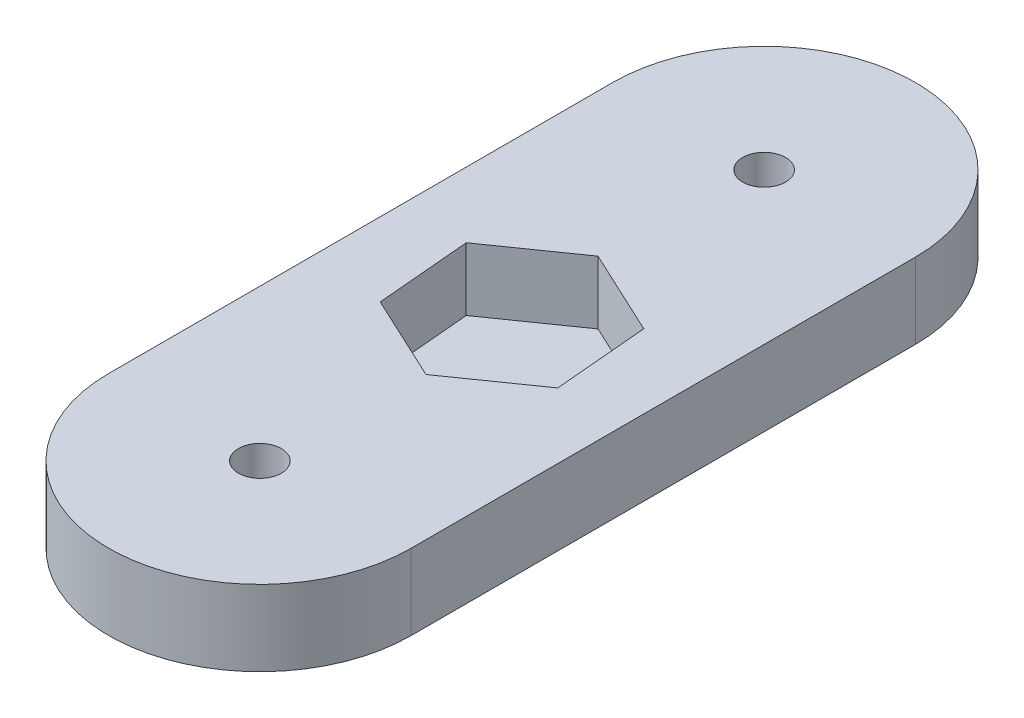
ISO-10303-21;
HEADER;
FILE_DESCRIPTION(('STEP AP214'),'2;1');
FILE_NAME('part.step','',(''),(''),'','','');
FILE_SCHEMA(('AUTOMOTIVE_DESIGN { 1 0 10303 214 1 1 1 1 }'));
ENDSEC;
DATA;
#1=APPLICATION_CONTEXT('core data for automotive mechanical design processes');
#2=APPLICATION_PROTOCOL_DEFINITION('international standard','automotive_design',2000,#1);
#3=PRODUCT_CONTEXT('',#1,'mechanical');
#4=PRODUCT('Part','Part','',(#3));
#5=PRODUCT_RELATED_PRODUCT_CATEGORY('part','',(#4));
#6=PRODUCT_DEFINITION_FORMATION('','',#4);
#7=PRODUCT_DEFINITION_CONTEXT('part definition',#1,'design');
#8=PRODUCT_DEFINITION('design','',#6,#7);
#9=PRODUCT_DEFINITION_SHAPE('','',#8);
#10=(LENGTH_UNIT() NAMED_UNIT(*) SI_UNIT(.MILLI.,.METRE.));
#11=(NAMED_UNIT(*) PLANE_ANGLE_UNIT() SI_UNIT($,.RADIAN.));
#12=(NAMED_UNIT(*) SI_UNIT($,.STERADIAN.) SOLID_ANGLE_UNIT());
#13=UNCERTAINTY_MEASURE_WITH_UNIT(LENGTH_MEASURE(1.E-05),#10,'distance_accuracy_value','');
#14=(GEOMETRIC_REPRESENTATION_CONTEXT(3) GLOBAL_UNCERTAINTY_ASSIGNED_CONTEXT((#13)) GLOBAL_UNIT_ASSIGNED_CONTEXT((#10,
#11,#12)) REPRESENTATION_CONTEXT('',''));
#15=CARTESIAN_POINT('',(0.,0.,0.));
#16=DIRECTION('',(0.,0.,1.));
#17=DIRECTION('',(1.,0.,0.));
#18=AXIS2_PLACEMENT_3D('',#15,#16,#17);
#19=CARTESIAN_POINT('',(0.,6.,0.));
#20=DIRECTION('',(0.,1.,0.));
#21=DIRECTION('',(0.,0.,1.));
#22=AXIS2_PLACEMENT_3D('',#19,#20,#21);
#23=PLANE('',#22);
#24=DIRECTION('',(0.906307787036651,0.,0.422618261740697));
#25=VECTOR('',#24,1.);
#26=CARTESIAN_POINT('',(-6.14818949260725,6.,-15.6949913709347));
#27=LINE('',#26,#25);
#28=CARTESIAN_POINT('',(-6.14818949260725,6.,-15.6949913709347));
#29=VERTEX_POINT('',#28);
#30=CARTESIAN_POINT('',(0.654152089978187,6.,-12.5230073975889));
#31=VERTEX_POINT('',#30);
#32=EDGE_CURVE('E48',#29,#31,#27,.T.);
#33=ORIENTED_EDGE('',*,*,#32,.F.);
#34=DIRECTION('',(0.0871557427476607,0.,0.996194698091745));
#35=VECTOR('',#34,1.);
#36=CARTESIAN_POINT('',(-6.80234158258544,6.,-23.1719839733458));
#37=LINE('',#36,#35);
#38=CARTESIAN_POINT('',(-6.80234158258544,6.,-23.1719839733458));
#39=VERTEX_POINT('',#38);
#40=EDGE_CURVE('E140',#39,#29,#37,.T.);
#41=ORIENTED_EDGE('',*,*,#40,.F.);
#42=DIRECTION('',(-0.819152044288991,0.,0.573576436351048));
#43=VECTOR('',#42,1.);
#44=CARTESIAN_POINT('',(-0.654152089978185,6.,-27.4769926024111));
#45=LINE('',#44,#43);
#46=CARTESIAN_POINT('',(-0.654152089978185,6.,-27.4769926024111));
#47=VERTEX_POINT('',#46);
#48=EDGE_CURVE('E143',#47,#39,#45,.T.);
#49=ORIENTED_EDGE('',*,*,#48,.F.);
#50=DIRECTION('',(-0.906307787036651,0.,-0.422618261740697));
#51=VECTOR('',#50,1.);
#52=CARTESIAN_POINT('',(6.14818949260725,6.,-24.3050086290654));
#53=LINE('',#52,#51);
#54=CARTESIAN_POINT('',(6.14818949260725,6.,-24.3050086290654));
#55=VERTEX_POINT('',#54);
#56=EDGE_CURVE('E159',#55,#47,#53,.T.);
#57=ORIENTED_EDGE('',*,*,#56,.F.);
#58=DIRECTION('',(-0.087155742747661,0.,-0.996194698091745));
#59=VECTOR('',#58,1.);
#60=CARTESIAN_POINT('',(6.80234158258544,6.,-16.8280160266542));
#61=LINE('',#60,#59);
#62=CARTESIAN_POINT('',(6.80234158258544,6.,-16.8280160266542));
#63=VERTEX_POINT('',#62);
#64=EDGE_CURVE('E156',#63,#55,#61,.T.);
#65=ORIENTED_EDGE('',*,*,#64,.F.);
#66=DIRECTION('',(0.819152044288991,0.,-0.573576436351048));
#67=VECTOR('',#66,1.);
#68=CARTESIAN_POINT('',(0.654152089978187,6.,-12.5230073975889));
#69=LINE('',#68,#67);
#70=EDGE_CURVE('E154',#31,#63,#69,.T.);
#71=ORIENTED_EDGE('',*,*,#70,.F.);
#72=EDGE_LOOP('',(#33,#41,#49,#57,#65,#71));
#73=FACE_BOUND('',#72,.T.);
#74=CARTESIAN_POINT('',(0.,6.,-40.));
#75=DIRECTION('',(0.,1.,0.));
#76=DIRECTION('',(0.,0.,1.));
#77=AXIS2_PLACEMENT_3D('',#74,#75,#76);
#78=CIRCLE('',#77,1.7);
#79=CARTESIAN_POINT('',(0.,6.,-38.3));
#80=VERTEX_POINT('',#79);
#81=EDGE_CURVE('E180',#80,#80,#78,.T.);
#82=ORIENTED_EDGE('',*,*,#81,.F.);
#83=EDGE_LOOP('',(#82));
#84=FACE_BOUND('',#83,.T.);
#85=CARTESIAN_POINT('',(0.,6.,0.));
#86=DIRECTION('',(0.,1.,0.));
#87=DIRECTION('',(0.,0.,1.));
#88=AXIS2_PLACEMENT_3D('',#85,#86,#87);
#89=CIRCLE('',#88,12.);
#90=CARTESIAN_POINT('',(-12.,6.,0.));
#91=VERTEX_POINT('',#90);
#92=CARTESIAN_POINT('',(12.,6.,0.));
#93=VERTEX_POINT('',#92);
#94=EDGE_CURVE('E186',#91,#93,#89,.T.);
#95=ORIENTED_EDGE('',*,*,#94,.T.);
#96=DIRECTION('',(0.,0.,-1.));
#97=VECTOR('',#96,1.);
#98=CARTESIAN_POINT('',(12.,6.,0.));
#99=LINE('',#98,#97);
#100=CARTESIAN_POINT('',(12.,6.,-40.));
#101=VERTEX_POINT('',#100);
#102=EDGE_CURVE('E85',#93,#101,#99,.T.);
#103=ORIENTED_EDGE('',*,*,#102,.T.);
#104=CARTESIAN_POINT('',(0.,6.,-40.));
#105=DIRECTION('',(0.,1.,0.));
#106=DIRECTION('',(0.,0.,1.));
#107=AXIS2_PLACEMENT_3D('',#104,#105,#106);
#108=CIRCLE('',#107,12.);
#109=CARTESIAN_POINT('',(-12.,6.,-40.));
#110=VERTEX_POINT('',#109);
#111=EDGE_CURVE('E189',#101,#110,#108,.T.);
#112=ORIENTED_EDGE('',*,*,#111,.T.);
#113=DIRECTION('',(0.,0.,1.));
#114=VECTOR('',#113,1.);
#115=CARTESIAN_POINT('',(-12.,6.,0.));
#116=LINE('',#115,#114);
#117=EDGE_CURVE('E57',#110,#91,#116,.T.);
#118=ORIENTED_EDGE('',*,*,#117,.T.);
#119=EDGE_LOOP('',(#95,#103,#112,#118));
#120=FACE_BOUND('',#119,.T.);
#121=CARTESIAN_POINT('',(0.,6.,0.));
#122=DIRECTION('',(0.,1.,0.));
#123=DIRECTION('',(0.,0.,1.));
#124=AXIS2_PLACEMENT_3D('',#121,#122,#123);
#125=CIRCLE('',#124,1.7);
#126=CARTESIAN_POINT('',(0.,6.,1.7));
#127=VERTEX_POINT('',#126);
#128=EDGE_CURVE('E174',#127,#127,#125,.T.);
#129=ORIENTED_EDGE('',*,*,#128,.F.);
#130=EDGE_LOOP('',(#129));
#131=FACE_BOUND('',#130,.T.);
#132=ADVANCED_FACE('F33',(#73,#84,#120,#131),#23,.T.);
#133=CARTESIAN_POINT('',(0.,0.,0.));
#134=DIRECTION('',(0.,1.,0.));
#135=DIRECTION('',(0.,0.,1.));
#136=AXIS2_PLACEMENT_3D('',#133,#134,#135);
#137=PLANE('',#136);
#138=CARTESIAN_POINT('',(0.,0.,-40.));
#139=DIRECTION('',(0.,1.,0.));
#140=DIRECTION('',(0.,0.,1.));
#141=AXIS2_PLACEMENT_3D('',#138,#139,#140);
#142=CIRCLE('',#141,1.7);
#143=CARTESIAN_POINT('',(0.,0.,-38.3));
#144=VERTEX_POINT('',#143);
#145=EDGE_CURVE('E177',#144,#144,#142,.T.);
#146=ORIENTED_EDGE('',*,*,#145,.T.);
#147=EDGE_LOOP('',(#146));
#148=FACE_BOUND('',#147,.T.);
#149=CARTESIAN_POINT('',(0.,0.,0.));
#150=DIRECTION('',(0.,1.,0.));
#151=DIRECTION('',(0.,0.,1.));
#152=AXIS2_PLACEMENT_3D('',#149,#150,#151);
#153=CIRCLE('',#152,12.);
#154=CARTESIAN_POINT('',(-12.,0.,0.));
#155=VERTEX_POINT('',#154);
#156=CARTESIAN_POINT('',(12.,0.,0.));
#157=VERTEX_POINT('',#156);
#158=EDGE_CURVE('E183',#155,#157,#153,.T.);
#159=ORIENTED_EDGE('',*,*,#158,.F.);
#160=DIRECTION('',(0.,0.,1.));
#161=VECTOR('',#160,1.);
#162=CARTESIAN_POINT('',(-12.,0.,0.));
#163=LINE('',#162,#161);
#164=CARTESIAN_POINT('',(-12.,0.,-40.));
#165=VERTEX_POINT('',#164);
#166=EDGE_CURVE('E78',#165,#155,#163,.T.);
#167=ORIENTED_EDGE('',*,*,#166,.F.);
#168=CARTESIAN_POINT('',(0.,0.,-40.));
#169=DIRECTION('',(0.,1.,0.));
#170=DIRECTION('',(0.,0.,1.));
#171=AXIS2_PLACEMENT_3D('',#168,#169,#170);
#172=CIRCLE('',#171,12.);
#173=CARTESIAN_POINT('',(12.,0.,-40.));
#174=VERTEX_POINT('',#173);
#175=EDGE_CURVE('E197',#174,#165,#172,.T.);
#176=ORIENTED_EDGE('',*,*,#175,.F.);
#177=DIRECTION('',(0.,0.,-1.));
#178=VECTOR('',#177,1.);
#179=CARTESIAN_POINT('',(12.,0.,0.));
#180=LINE('',#179,#178);
#181=EDGE_CURVE('E195',#157,#174,#180,.T.);
#182=ORIENTED_EDGE('',*,*,#181,.F.);
#183=EDGE_LOOP('',(#159,#167,#176,#182));
#184=FACE_BOUND('',#183,.T.);
#185=CARTESIAN_POINT('',(0.,0.,0.));
#186=DIRECTION('',(0.,1.,0.));
#187=DIRECTION('',(0.,0.,1.));
#188=AXIS2_PLACEMENT_3D('',#185,#186,#187);
#189=CIRCLE('',#188,1.7);
#190=CARTESIAN_POINT('',(0.,0.,1.7));
#191=VERTEX_POINT('',#190);
#192=EDGE_CURVE('E166',#191,#191,#189,.T.);
#193=ORIENTED_EDGE('',*,*,#192,.T.);
#194=EDGE_LOOP('',(#193));
#195=FACE_BOUND('',#194,.T.);
#196=ADVANCED_FACE('F210',(#148,#184,#195),#137,.F.);
#197=CARTESIAN_POINT('',(0.,6.,0.));
#198=DIRECTION('',(0.,-1.,0.));
#199=DIRECTION('',(0.,0.,-1.));
#200=AXIS2_PLACEMENT_3D('',#197,#198,#199);
#201=CYLINDRICAL_SURFACE('',#200,12.);
#202=ORIENTED_EDGE('',*,*,#158,.T.);
#203=DIRECTION('',(0.,-1.,0.));
#204=VECTOR('',#203,1.);
#205=CARTESIAN_POINT('',(12.,6.,0.));
#206=LINE('',#205,#204);
#207=EDGE_CURVE('E11',#93,#157,#206,.T.);
#208=ORIENTED_EDGE('',*,*,#207,.F.);
#209=ORIENTED_EDGE('',*,*,#94,.F.);
#210=DIRECTION('',(0.,-1.,0.));
#211=VECTOR('',#210,1.);
#212=CARTESIAN_POINT('',(-12.,6.,0.));
#213=LINE('',#212,#211);
#214=EDGE_CURVE('E192',#91,#155,#213,.T.);
#215=ORIENTED_EDGE('',*,*,#214,.T.);
#216=EDGE_LOOP('',(#202,#208,#209,#215));
#217=FACE_BOUND('',#216,.T.);
#218=ADVANCED_FACE('F35',(#217),#201,.T.);
#219=CARTESIAN_POINT('',(12.,6.,0.));
#220=DIRECTION('',(-1.,0.,0.));
#221=DIRECTION('',(0.,0.,1.));
#222=AXIS2_PLACEMENT_3D('',#219,#220,#221);
#223=PLANE('',#222);
#224=ORIENTED_EDGE('',*,*,#181,.T.);
#225=DIRECTION('',(0.,-1.,0.));
#226=VECTOR('',#225,1.);
#227=CARTESIAN_POINT('',(12.,6.,-40.));
#228=LINE('',#227,#226);
#229=EDGE_CURVE('E41',#101,#174,#228,.T.);
#230=ORIENTED_EDGE('',*,*,#229,.F.);
#231=ORIENTED_EDGE('',*,*,#102,.F.);
#232=ORIENTED_EDGE('',*,*,#207,.T.);
#233=EDGE_LOOP('',(#224,#230,#231,#232));
#234=FACE_BOUND('',#233,.T.);
#235=ADVANCED_FACE('F226',(#234),#223,.F.);
#236=CARTESIAN_POINT('',(0.,6.,-40.));
#237=DIRECTION('',(0.,-1.,0.));
#238=DIRECTION('',(0.,0.,-1.));
#239=AXIS2_PLACEMENT_3D('',#236,#237,#238);
#240=CYLINDRICAL_SURFACE('',#239,12.);
#241=ORIENTED_EDGE('',*,*,#175,.T.);
#242=DIRECTION('',(0.,-1.,0.));
#243=VECTOR('',#242,1.);
#244=CARTESIAN_POINT('',(-12.,6.,-40.));
#245=LINE('',#244,#243);
#246=EDGE_CURVE('E201',#110,#165,#245,.T.);
#247=ORIENTED_EDGE('',*,*,#246,.F.);
#248=ORIENTED_EDGE('',*,*,#111,.F.);
#249=ORIENTED_EDGE('',*,*,#229,.T.);
#250=EDGE_LOOP('',(#241,#247,#248,#249));
#251=FACE_BOUND('',#250,.T.);
#252=ADVANCED_FACE('F206',(#251),#240,.T.);
#253=CARTESIAN_POINT('',(-12.,6.,0.));
#254=DIRECTION('',(1.,0.,0.));
#255=DIRECTION('',(0.,0.,-1.));
#256=AXIS2_PLACEMENT_3D('',#253,#254,#255);
#257=PLANE('',#256);
#258=ORIENTED_EDGE('',*,*,#166,.T.);
#259=ORIENTED_EDGE('',*,*,#214,.F.);
#260=ORIENTED_EDGE('',*,*,#117,.F.);
#261=ORIENTED_EDGE('',*,*,#246,.T.);
#262=EDGE_LOOP('',(#258,#259,#260,#261));
#263=FACE_BOUND('',#262,.T.);
#264=ADVANCED_FACE('F215',(#263),#257,.F.);
#265=CARTESIAN_POINT('',(0.,6.,-40.));
#266=DIRECTION('',(0.,-1.,0.));
#267=DIRECTION('',(0.,0.,-1.));
#268=AXIS2_PLACEMENT_3D('',#265,#266,#267);
#269=CYLINDRICAL_SURFACE('',#268,1.7);
#270=ORIENTED_EDGE('',*,*,#81,.T.);
#271=EDGE_LOOP('',(#270));
#272=FACE_BOUND('',#271,.T.);
#273=ORIENTED_EDGE('',*,*,#145,.F.);
#274=EDGE_LOOP('',(#273));
#275=FACE_BOUND('',#274,.T.);
#276=ADVANCED_FACE('F217',(#272,#275),#269,.F.);
#277=CARTESIAN_POINT('',(0.,6.,0.));
#278=DIRECTION('',(0.,-1.,0.));
#279=DIRECTION('',(0.,0.,-1.));
#280=AXIS2_PLACEMENT_3D('',#277,#278,#279);
#281=CYLINDRICAL_SURFACE('',#280,1.7);
#282=ORIENTED_EDGE('',*,*,#128,.T.);
#283=EDGE_LOOP('',(#282));
#284=FACE_BOUND('',#283,.T.);
#285=ORIENTED_EDGE('',*,*,#192,.F.);
#286=EDGE_LOOP('',(#285));
#287=FACE_BOUND('',#286,.T.);
#288=ADVANCED_FACE('F223',(#284,#287),#281,.F.);
#289=CARTESIAN_POINT('',(-6.14818949260725,1.,-15.6949913709347));
#290=DIRECTION('',(-0.422618261740697,0.,0.906307787036651));
#291=DIRECTION('',(0.906307787036651,0.,0.422618261740697));
#292=AXIS2_PLACEMENT_3D('',#289,#290,#291);
#293=PLANE('',#292);
#294=ORIENTED_EDGE('',*,*,#32,.T.);
#295=DIRECTION('',(0.,1.,0.));
#296=VECTOR('',#295,1.);
#297=CARTESIAN_POINT('',(0.654152089978187,1.,-12.5230073975889));
#298=LINE('',#297,#296);
#299=CARTESIAN_POINT('',(0.654152089978187,1.,-12.5230073975889));
#300=VERTEX_POINT('',#299);
#301=EDGE_CURVE('E117',#300,#31,#298,.T.);
#302=ORIENTED_EDGE('',*,*,#301,.F.);
#303=DIRECTION('',(0.906307787036651,0.,0.422618261740697));
#304=VECTOR('',#303,1.);
#305=CARTESIAN_POINT('',(-6.14818949260725,1.,-15.6949913709347));
#306=LINE('',#305,#304);
#307=CARTESIAN_POINT('',(-6.14818949260725,1.,-15.6949913709347));
#308=VERTEX_POINT('',#307);
#309=EDGE_CURVE('E121',#308,#300,#306,.T.);
#310=ORIENTED_EDGE('',*,*,#309,.F.);
#311=DIRECTION('',(0.,1.,0.));
#312=VECTOR('',#311,1.);
#313=CARTESIAN_POINT('',(-6.14818949260725,1.,-15.6949913709347));
#314=LINE('',#313,#312);
#315=EDGE_CURVE('E164',#308,#29,#314,.T.);
#316=ORIENTED_EDGE('',*,*,#315,.T.);
#317=EDGE_LOOP('',(#294,#302,#310,#316));
#318=FACE_BOUND('',#317,.T.);
#319=ADVANCED_FACE('F119',(#318),#293,.F.);
#320=CARTESIAN_POINT('',(-6.80234158258544,1.,-23.1719839733458));
#321=DIRECTION('',(-0.996194698091745,0.,0.0871557427476607));
#322=DIRECTION('',(0.0871557427476607,0.,0.996194698091745));
#323=AXIS2_PLACEMENT_3D('',#320,#321,#322);
#324=PLANE('',#323);
#325=ORIENTED_EDGE('',*,*,#40,.T.);
#326=ORIENTED_EDGE('',*,*,#315,.F.);
#327=DIRECTION('',(0.0871557427476607,0.,0.996194698091745));
#328=VECTOR('',#327,1.);
#329=CARTESIAN_POINT('',(-6.80234158258544,1.,-23.1719839733458));
#330=LINE('',#329,#328);
#331=CARTESIAN_POINT('',(-6.80234158258544,1.,-23.1719839733458));
#332=VERTEX_POINT('',#331);
#333=EDGE_CURVE('E127',#332,#308,#330,.T.);
#334=ORIENTED_EDGE('',*,*,#333,.F.);
#335=DIRECTION('',(0.,1.,0.));
#336=VECTOR('',#335,1.);
#337=CARTESIAN_POINT('',(-6.80234158258544,1.,-23.1719839733458));
#338=LINE('',#337,#336);
#339=EDGE_CURVE('E167',#332,#39,#338,.T.);
#340=ORIENTED_EDGE('',*,*,#339,.T.);
#341=EDGE_LOOP('',(#325,#326,#334,#340));
#342=FACE_BOUND('',#341,.T.);
#343=ADVANCED_FACE('F243',(#342),#324,.F.);
#344=CARTESIAN_POINT('',(-0.654152089978185,1.,-27.4769926024111));
#345=DIRECTION('',(-0.573576436351048,0.,-0.81915204428899));
#346=DIRECTION('',(-0.81915204428899,0.,0.573576436351048));
#347=AXIS2_PLACEMENT_3D('',#344,#345,#346);
#348=PLANE('',#347);
#349=ORIENTED_EDGE('',*,*,#48,.T.);
#350=ORIENTED_EDGE('',*,*,#339,.F.);
#351=DIRECTION('',(-0.819152044288991,0.,0.573576436351048));
#352=VECTOR('',#351,1.);
#353=CARTESIAN_POINT('',(-0.654152089978185,1.,-27.4769926024111));
#354=LINE('',#353,#352);
#355=CARTESIAN_POINT('',(-0.654152089978185,1.,-27.4769926024111));
#356=VERTEX_POINT('',#355);
#357=EDGE_CURVE('E150',#356,#332,#354,.T.);
#358=ORIENTED_EDGE('',*,*,#357,.F.);
#359=DIRECTION('',(0.,1.,0.));
#360=VECTOR('',#359,1.);
#361=CARTESIAN_POINT('',(-0.654152089978185,1.,-27.4769926024111));
#362=LINE('',#361,#360);
#363=EDGE_CURVE('E169',#356,#47,#362,.T.);
#364=ORIENTED_EDGE('',*,*,#363,.T.);
#365=EDGE_LOOP('',(#349,#350,#358,#364));
#366=FACE_BOUND('',#365,.T.);
#367=ADVANCED_FACE('F253',(#366),#348,.F.);
#368=CARTESIAN_POINT('',(6.14818949260725,1.,-24.3050086290654));
#369=DIRECTION('',(0.422618261740697,0.,-0.906307787036651));
#370=DIRECTION('',(-0.906307787036651,0.,-0.422618261740697));
#371=AXIS2_PLACEMENT_3D('',#368,#369,#370);
#372=PLANE('',#371);
#373=ORIENTED_EDGE('',*,*,#56,.T.);
#374=ORIENTED_EDGE('',*,*,#363,.F.);
#375=DIRECTION('',(-0.906307787036651,0.,-0.422618261740697));
#376=VECTOR('',#375,1.);
#377=CARTESIAN_POINT('',(6.14818949260725,1.,-24.3050086290654));
#378=LINE('',#377,#376);
#379=CARTESIAN_POINT('',(6.14818949260725,1.,-24.3050086290654));
#380=VERTEX_POINT('',#379);
#381=EDGE_CURVE('E147',#380,#356,#378,.T.);
#382=ORIENTED_EDGE('',*,*,#381,.F.);
#383=DIRECTION('',(0.,1.,0.));
#384=VECTOR('',#383,1.);
#385=CARTESIAN_POINT('',(6.14818949260725,1.,-24.3050086290654));
#386=LINE('',#385,#384);
#387=EDGE_CURVE('E171',#380,#55,#386,.T.);
#388=ORIENTED_EDGE('',*,*,#387,.T.);
#389=EDGE_LOOP('',(#373,#374,#382,#388));
#390=FACE_BOUND('',#389,.T.);
#391=ADVANCED_FACE('F249',(#390),#372,.F.);
#392=CARTESIAN_POINT('',(6.80234158258544,1.,-16.8280160266542));
#393=DIRECTION('',(0.996194698091745,0.,-0.087155742747661));
#394=DIRECTION('',(-0.087155742747661,0.,-0.996194698091745));
#395=AXIS2_PLACEMENT_3D('',#392,#393,#394);
#396=PLANE('',#395);
#397=ORIENTED_EDGE('',*,*,#64,.T.);
#398=ORIENTED_EDGE('',*,*,#387,.F.);
#399=DIRECTION('',(-0.087155742747661,0.,-0.996194698091745));
#400=VECTOR('',#399,1.);
#401=CARTESIAN_POINT('',(6.80234158258544,1.,-16.8280160266542));
#402=LINE('',#401,#400);
#403=CARTESIAN_POINT('',(6.80234158258544,1.,-16.8280160266542));
#404=VERTEX_POINT('',#403);
#405=EDGE_CURVE('E135',#404,#380,#402,.T.);
#406=ORIENTED_EDGE('',*,*,#405,.F.);
#407=DIRECTION('',(0.,1.,0.));
#408=VECTOR('',#407,1.);
#409=CARTESIAN_POINT('',(6.80234158258544,1.,-16.8280160266542));
#410=LINE('',#409,#408);
#411=EDGE_CURVE('E126',#404,#63,#410,.T.);
#412=ORIENTED_EDGE('',*,*,#411,.T.);
#413=EDGE_LOOP('',(#397,#398,#406,#412));
#414=FACE_BOUND('',#413,.T.);
#415=ADVANCED_FACE('F246',(#414),#396,.F.);
#416=CARTESIAN_POINT('',(0.654152089978187,1.,-12.5230073975889));
#417=DIRECTION('',(0.573576436351048,0.,0.819152044288991));
#418=DIRECTION('',(0.819152044288991,0.,-0.573576436351048));
#419=AXIS2_PLACEMENT_3D('',#416,#417,#418);
#420=PLANE('',#419);
#421=ORIENTED_EDGE('',*,*,#70,.T.);
#422=ORIENTED_EDGE('',*,*,#411,.F.);
#423=DIRECTION('',(0.819152044288991,0.,-0.573576436351048));
#424=VECTOR('',#423,1.);
#425=CARTESIAN_POINT('',(0.654152089978187,1.,-12.5230073975889));
#426=LINE('',#425,#424);
#427=EDGE_CURVE('E130',#300,#404,#426,.T.);
#428=ORIENTED_EDGE('',*,*,#427,.F.);
#429=ORIENTED_EDGE('',*,*,#301,.T.);
#430=EDGE_LOOP('',(#421,#422,#428,#429));
#431=FACE_BOUND('',#430,.T.);
#432=ADVANCED_FACE('F131',(#431),#420,.F.);
#433=CARTESIAN_POINT('',(0.,1.,0.));
#434=DIRECTION('',(0.,1.,0.));
#435=DIRECTION('',(0.,0.,1.));
#436=AXIS2_PLACEMENT_3D('',#433,#434,#435);
#437=PLANE('',#436);
#438=ORIENTED_EDGE('',*,*,#309,.T.);
#439=ORIENTED_EDGE('',*,*,#427,.T.);
#440=ORIENTED_EDGE('',*,*,#405,.T.);
#441=ORIENTED_EDGE('',*,*,#381,.T.);
#442=ORIENTED_EDGE('',*,*,#357,.T.);
#443=ORIENTED_EDGE('',*,*,#333,.T.);
#444=EDGE_LOOP('',(#438,#439,#440,#441,#442,#443));
#445=FACE_BOUND('',#444,.T.);
#446=ADVANCED_FACE('F137',(#445),#437,.T.);
#447=CLOSED_SHELL('',(#132,#196,#218,#235,#252,#264,#276,#288,#319,#343,#367,#391,#415,#432,#446));
#448=MANIFOLD_SOLID_BREP('B2',#447);
#449=ADVANCED_BREP_SHAPE_REPRESENTATION('',(#18,#448),#14);
#450=SHAPE_DEFINITION_REPRESENTATION(#9,#449);
ENDSEC;
END-ISO-10303-21;
